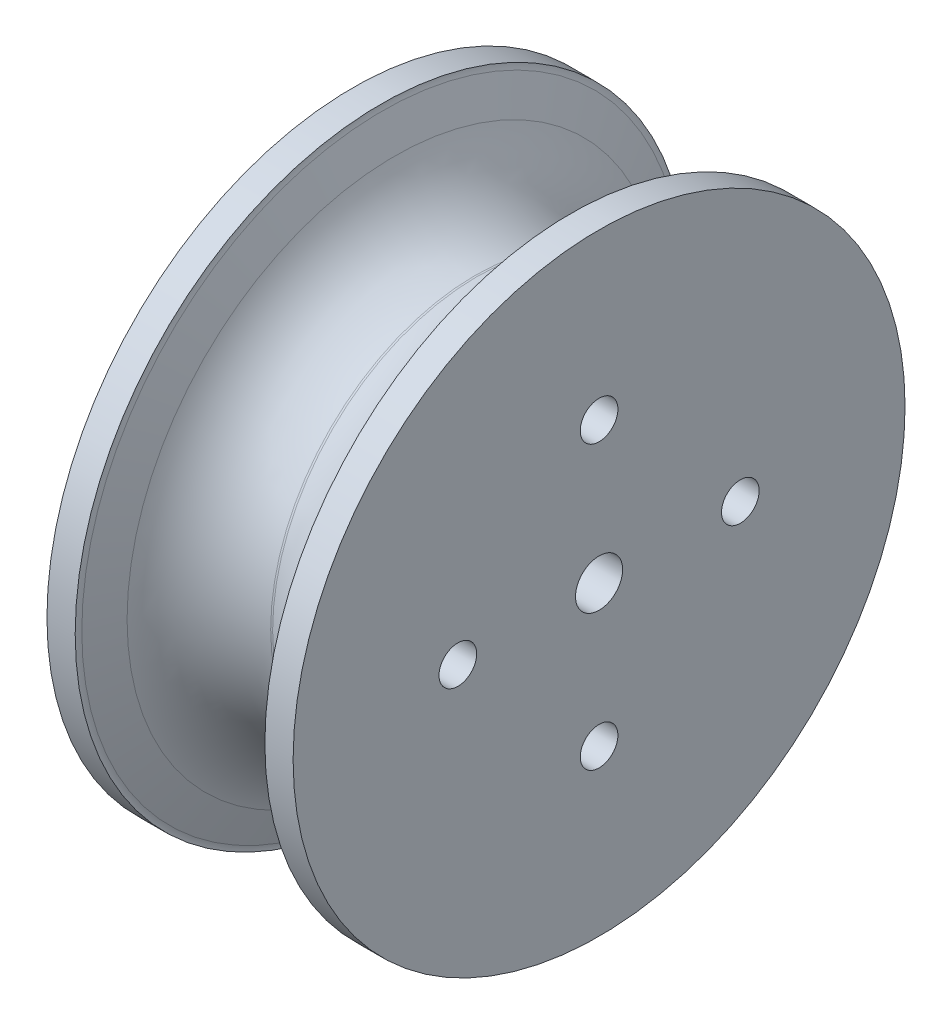
ISO-10303-21;
HEADER;
FILE_DESCRIPTION(('STEP AP214'),'2;1');
FILE_NAME('part.step','',(''),(''),'','','');
FILE_SCHEMA(('AUTOMOTIVE_DESIGN { 1 0 10303 214 1 1 1 1 }'));
ENDSEC;
DATA;
#1=APPLICATION_CONTEXT('core data for automotive mechanical design processes');
#2=APPLICATION_PROTOCOL_DEFINITION('international standard','automotive_design',2000,#1);
#3=PRODUCT_CONTEXT('',#1,'mechanical');
#4=PRODUCT('Part','Part','',(#3));
#5=PRODUCT_RELATED_PRODUCT_CATEGORY('part','',(#4));
#6=PRODUCT_DEFINITION_FORMATION('','',#4);
#7=PRODUCT_DEFINITION_CONTEXT('part definition',#1,'design');
#8=PRODUCT_DEFINITION('design','',#6,#7);
#9=PRODUCT_DEFINITION_SHAPE('','',#8);
#10=(LENGTH_UNIT() NAMED_UNIT(*) SI_UNIT(.MILLI.,.METRE.));
#11=(NAMED_UNIT(*) PLANE_ANGLE_UNIT() SI_UNIT($,.RADIAN.));
#12=(NAMED_UNIT(*) SI_UNIT($,.STERADIAN.) SOLID_ANGLE_UNIT());
#13=UNCERTAINTY_MEASURE_WITH_UNIT(LENGTH_MEASURE(1.E-05),#10,'distance_accuracy_value','');
#14=(GEOMETRIC_REPRESENTATION_CONTEXT(3) GLOBAL_UNCERTAINTY_ASSIGNED_CONTEXT((#13)) GLOBAL_UNIT_ASSIGNED_CONTEXT((#10,
#11,#12)) REPRESENTATION_CONTEXT('',''));
#15=CARTESIAN_POINT('',(0.,0.,0.));
#16=DIRECTION('',(0.,0.,1.));
#17=DIRECTION('',(1.,0.,0.));
#18=AXIS2_PLACEMENT_3D('',#15,#16,#17);
#19=CARTESIAN_POINT('',(0.,53.6000552133651,0.));
#20=DIRECTION('',(-1.,0.,0.));
#21=DIRECTION('',(0.,0.,1.));
#22=AXIS2_PLACEMENT_3D('',#19,#20,#21);
#23=TOROIDAL_SURFACE('',#22,22.5394735116362,0.839475181127807);
#24=CARTESIAN_POINT('',(-0.101961367565274,53.6000552133651,0.));
#25=DIRECTION('',(-1.,0.,0.));
#26=DIRECTION('',(0.,0.,1.));
#27=AXIS2_PLACEMENT_3D('',#24,#25,#26);
#28=CIRCLE('',#27,21.7062133726317);
#29=CARTESIAN_POINT('',(-0.101961367565274,53.6000552133651,21.7062133726317));
#30=VERTEX_POINT('',#29);
#31=EDGE_CURVE('E73',#30,#30,#28,.T.);
#32=ORIENTED_EDGE('',*,*,#31,.F.);
#33=EDGE_LOOP('',(#32));
#34=FACE_BOUND('',#33,.T.);
#35=CARTESIAN_POINT('',(0.101961367565274,53.6000552133651,0.));
#36=DIRECTION('',(-1.,0.,0.));
#37=DIRECTION('',(0.,0.,1.));
#38=AXIS2_PLACEMENT_3D('',#35,#36,#37);
#39=CIRCLE('',#38,21.7062133726317);
#40=CARTESIAN_POINT('',(0.101961367565274,53.6000552133651,21.7062133726317));
#41=VERTEX_POINT('',#40);
#42=EDGE_CURVE('E10',#41,#41,#39,.T.);
#43=ORIENTED_EDGE('',*,*,#42,.T.);
#44=EDGE_LOOP('',(#43));
#45=FACE_BOUND('',#44,.T.);
#46=ADVANCED_FACE('F33',(#34,#45),#23,.F.);
#47=CARTESIAN_POINT('',(-1.17297799352419,53.6000552133651,0.));
#48=DIRECTION('',(-1.,0.,0.));
#49=DIRECTION('',(0.,0.,1.));
#50=AXIS2_PLACEMENT_3D('',#47,#48,#49);
#51=TOROIDAL_SURFACE('',#50,32.1254160040951,10.4969163972068);
#52=CARTESIAN_POINT('',(8.64659436561641,53.6000552133651,0.));
#53=DIRECTION('',(-1.,0.,0.));
#54=DIRECTION('',(0.,0.,1.));
#55=AXIS2_PLACEMENT_3D('',#52,#53,#54);
#56=CIRCLE('',#55,28.4157997795309);
#57=CARTESIAN_POINT('',(8.64659436561641,53.6000552133651,28.4157997795309));
#58=VERTEX_POINT('',#57);
#59=EDGE_CURVE('E39',#58,#58,#56,.T.);
#60=ORIENTED_EDGE('',*,*,#59,.T.);
#61=EDGE_LOOP('',(#60));
#62=FACE_BOUND('',#61,.T.);
#63=ORIENTED_EDGE('',*,*,#42,.F.);
#64=EDGE_LOOP('',(#63));
#65=FACE_BOUND('',#64,.T.);
#66=ADVANCED_FACE('F132',(#62,#65),#51,.F.);
#67=CARTESIAN_POINT('',(9.96536302181998,53.6000552133651,0.));
#68=DIRECTION('',(1.,0.,0.));
#69=DIRECTION('',(0.,0.,-1.));
#70=AXIS2_PLACEMENT_3D('',#67,#68,#69);
#71=CONICAL_SURFACE('',#70,31.9066579871286,1.20959257130122);
#72=ORIENTED_EDGE('',*,*,#59,.F.);
#73=EDGE_LOOP('',(#72));
#74=FACE_BOUND('',#73,.T.);
#75=CARTESIAN_POINT('',(9.96536302181998,53.6000552133651,0.));
#76=DIRECTION('',(-1.,0.,0.));
#77=DIRECTION('',(0.,0.,1.));
#78=AXIS2_PLACEMENT_3D('',#75,#76,#77);
#79=CIRCLE('',#78,31.9066579871286);
#80=CARTESIAN_POINT('',(9.96536302181998,53.6000552133651,31.9066579871286));
#81=VERTEX_POINT('',#80);
#82=EDGE_CURVE('E43',#81,#81,#79,.T.);
#83=ORIENTED_EDGE('',*,*,#82,.T.);
#84=EDGE_LOOP('',(#83));
#85=FACE_BOUND('',#84,.T.);
#86=ADVANCED_FACE('F137',(#74,#85),#71,.T.);
#87=CARTESIAN_POINT('',(8.39475181127806,53.6000552133651,0.));
#88=DIRECTION('',(-1.,0.,0.));
#89=DIRECTION('',(0.,0.,1.));
#90=AXIS2_PLACEMENT_3D('',#87,#88,#89);
#91=TOROIDAL_SURFACE('',#90,32.5,1.67895036225561);
#92=CARTESIAN_POINT('',(10.0737021735337,53.6000552133651,0.));
#93=DIRECTION('',(-1.,0.,0.));
#94=DIRECTION('',(0.,0.,1.));
#95=AXIS2_PLACEMENT_3D('',#92,#93,#94);
#96=CIRCLE('',#95,32.5);
#97=CARTESIAN_POINT('',(10.0737021735337,53.6000552133651,32.5));
#98=VERTEX_POINT('',#97);
#99=EDGE_CURVE('E47',#98,#98,#96,.T.);
#100=ORIENTED_EDGE('',*,*,#99,.T.);
#101=EDGE_LOOP('',(#100));
#102=FACE_BOUND('',#101,.T.);
#103=ORIENTED_EDGE('',*,*,#82,.F.);
#104=EDGE_LOOP('',(#103));
#105=FACE_BOUND('',#104,.T.);
#106=ADVANCED_FACE('F247',(#102,#105),#91,.F.);
#107=CARTESIAN_POINT('',(-31.3430589886621,53.6000552133651,0.));
#108=DIRECTION('',(-1.,0.,0.));
#109=DIRECTION('',(0.,0.,1.));
#110=AXIS2_PLACEMENT_3D('',#107,#108,#109);
#111=CYLINDRICAL_SURFACE('',#110,32.5);
#112=CARTESIAN_POINT('',(13.0737021735337,53.6000552133651,0.));
#113=DIRECTION('',(-1.,0.,0.));
#114=DIRECTION('',(0.,0.,1.));
#115=AXIS2_PLACEMENT_3D('',#112,#113,#114);
#116=CIRCLE('',#115,32.5);
#117=CARTESIAN_POINT('',(13.0737021735337,53.6000552133651,32.5));
#118=VERTEX_POINT('',#117);
#119=EDGE_CURVE('E52',#118,#118,#116,.T.);
#120=ORIENTED_EDGE('',*,*,#119,.T.);
#121=EDGE_LOOP('',(#120));
#122=FACE_BOUND('',#121,.T.);
#123=ORIENTED_EDGE('',*,*,#99,.F.);
#124=EDGE_LOOP('',(#123));
#125=FACE_BOUND('',#124,.T.);
#126=ADVANCED_FACE('F127',(#122,#125),#111,.T.);
#127=CARTESIAN_POINT('',(13.0737021735337,0.,0.));
#128=DIRECTION('',(-1.,0.,0.));
#129=DIRECTION('',(0.,0.,1.));
#130=AXIS2_PLACEMENT_3D('',#127,#128,#129);
#131=PLANE('',#130);
#132=CARTESIAN_POINT('',(13.0737021735337,68.6000552133651,0.));
#133=DIRECTION('',(-1.,0.,0.));
#134=DIRECTION('',(0.,0.,1.));
#135=AXIS2_PLACEMENT_3D('',#132,#133,#134);
#136=CIRCLE('',#135,2.);
#137=CARTESIAN_POINT('',(13.0737021735337,68.6000552133651,2.));
#138=VERTEX_POINT('',#137);
#139=EDGE_CURVE('E76',#138,#138,#136,.T.);
#140=ORIENTED_EDGE('',*,*,#139,.T.);
#141=EDGE_LOOP('',(#140));
#142=FACE_BOUND('',#141,.T.);
#143=CARTESIAN_POINT('',(13.0737021735337,53.6000552133652,15.0000000000002));
#144=DIRECTION('',(-1.,0.,0.));
#145=DIRECTION('',(0.,0.,1.));
#146=AXIS2_PLACEMENT_3D('',#143,#144,#145);
#147=CIRCLE('',#146,2.);
#148=CARTESIAN_POINT('',(13.0737021735337,53.6000552133652,17.0000000000002));
#149=VERTEX_POINT('',#148);
#150=EDGE_CURVE('E79',#149,#149,#147,.T.);
#151=ORIENTED_EDGE('',*,*,#150,.T.);
#152=EDGE_LOOP('',(#151));
#153=FACE_BOUND('',#152,.T.);
#154=CARTESIAN_POINT('',(13.0737021735337,38.6000552133651,3.14233320495882E-13));
#155=DIRECTION('',(-1.,0.,0.));
#156=DIRECTION('',(0.,0.,1.));
#157=AXIS2_PLACEMENT_3D('',#154,#155,#156);
#158=CIRCLE('',#157,2.);
#159=CARTESIAN_POINT('',(13.0737021735337,38.6000552133651,2.00000000000031));
#160=VERTEX_POINT('',#159);
#161=EDGE_CURVE('E82',#160,#160,#158,.T.);
#162=ORIENTED_EDGE('',*,*,#161,.T.);
#163=EDGE_LOOP('',(#162));
#164=FACE_BOUND('',#163,.T.);
#165=CARTESIAN_POINT('',(13.0737021735337,53.600055213365,-14.9999999999998));
#166=DIRECTION('',(-1.,0.,0.));
#167=DIRECTION('',(0.,0.,1.));
#168=AXIS2_PLACEMENT_3D('',#165,#166,#167);
#169=CIRCLE('',#168,2.);
#170=CARTESIAN_POINT('',(13.0737021735337,53.600055213365,-12.9999999999998));
#171=VERTEX_POINT('',#170);
#172=EDGE_CURVE('E85',#171,#171,#169,.T.);
#173=ORIENTED_EDGE('',*,*,#172,.T.);
#174=EDGE_LOOP('',(#173));
#175=FACE_BOUND('',#174,.T.);
#176=ORIENTED_EDGE('',*,*,#119,.F.);
#177=EDGE_LOOP('',(#176));
#178=FACE_BOUND('',#177,.T.);
#179=CARTESIAN_POINT('',(13.0737021735337,53.6000552133651,0.));
#180=DIRECTION('',(-1.,0.,0.));
#181=DIRECTION('',(0.,0.,1.));
#182=AXIS2_PLACEMENT_3D('',#179,#180,#181);
#183=CIRCLE('',#182,2.5);
#184=CARTESIAN_POINT('',(13.0737021735337,53.6000552133651,2.5));
#185=VERTEX_POINT('',#184);
#186=EDGE_CURVE('E55',#185,#185,#183,.T.);
#187=ORIENTED_EDGE('',*,*,#186,.T.);
#188=EDGE_LOOP('',(#187));
#189=FACE_BOUND('',#188,.T.);
#190=ADVANCED_FACE('F121',(#142,#153,#164,#175,#178,#189),#131,.F.);
#191=CARTESIAN_POINT('',(-31.3430589886621,53.6000552133651,0.));
#192=DIRECTION('',(-1.,0.,0.));
#193=DIRECTION('',(0.,0.,1.));
#194=AXIS2_PLACEMENT_3D('',#191,#192,#193);
#195=CYLINDRICAL_SURFACE('',#194,2.5);
#196=ORIENTED_EDGE('',*,*,#186,.F.);
#197=EDGE_LOOP('',(#196));
#198=FACE_BOUND('',#197,.T.);
#199=CARTESIAN_POINT('',(-13.0737021735337,53.6000552133651,0.));
#200=DIRECTION('',(-1.,0.,0.));
#201=DIRECTION('',(0.,0.,1.));
#202=AXIS2_PLACEMENT_3D('',#199,#200,#201);
#203=CIRCLE('',#202,2.5);
#204=CARTESIAN_POINT('',(-13.0737021735337,53.6000552133651,2.5));
#205=VERTEX_POINT('',#204);
#206=EDGE_CURVE('E58',#205,#205,#203,.T.);
#207=ORIENTED_EDGE('',*,*,#206,.T.);
#208=EDGE_LOOP('',(#207));
#209=FACE_BOUND('',#208,.T.);
#210=ADVANCED_FACE('F108',(#198,#209),#195,.F.);
#211=CARTESIAN_POINT('',(-13.0737021735337,0.,0.));
#212=DIRECTION('',(-1.,0.,0.));
#213=DIRECTION('',(0.,0.,1.));
#214=AXIS2_PLACEMENT_3D('',#211,#212,#213);
#215=PLANE('',#214);
#216=CARTESIAN_POINT('',(-13.0737021735337,68.6000552133651,0.));
#217=DIRECTION('',(-1.,0.,0.));
#218=DIRECTION('',(0.,0.,1.));
#219=AXIS2_PLACEMENT_3D('',#216,#217,#218);
#220=CIRCLE('',#219,2.);
#221=CARTESIAN_POINT('',(-13.0737021735337,68.6000552133651,2.));
#222=VERTEX_POINT('',#221);
#223=EDGE_CURVE('E88',#222,#222,#220,.T.);
#224=ORIENTED_EDGE('',*,*,#223,.F.);
#225=EDGE_LOOP('',(#224));
#226=FACE_BOUND('',#225,.T.);
#227=CARTESIAN_POINT('',(-13.0737021735337,53.6000552133652,15.0000000000002));
#228=DIRECTION('',(-1.,0.,0.));
#229=DIRECTION('',(0.,0.,1.));
#230=AXIS2_PLACEMENT_3D('',#227,#228,#229);
#231=CIRCLE('',#230,2.);
#232=CARTESIAN_POINT('',(-13.0737021735337,53.6000552133652,17.0000000000002));
#233=VERTEX_POINT('',#232);
#234=EDGE_CURVE('E95',#233,#233,#231,.T.);
#235=ORIENTED_EDGE('',*,*,#234,.F.);
#236=EDGE_LOOP('',(#235));
#237=FACE_BOUND('',#236,.T.);
#238=CARTESIAN_POINT('',(-13.0737021735337,38.6000552133651,3.14233320495882E-13));
#239=DIRECTION('',(-1.,0.,0.));
#240=DIRECTION('',(0.,0.,1.));
#241=AXIS2_PLACEMENT_3D('',#238,#239,#240);
#242=CIRCLE('',#241,2.);
#243=CARTESIAN_POINT('',(-13.0737021735337,38.6000552133651,2.00000000000031));
#244=VERTEX_POINT('',#243);
#245=EDGE_CURVE('E92',#244,#244,#242,.T.);
#246=ORIENTED_EDGE('',*,*,#245,.F.);
#247=EDGE_LOOP('',(#246));
#248=FACE_BOUND('',#247,.T.);
#249=CARTESIAN_POINT('',(-13.0737021735337,53.600055213365,-14.9999999999998));
#250=DIRECTION('',(-1.,0.,0.));
#251=DIRECTION('',(0.,0.,1.));
#252=AXIS2_PLACEMENT_3D('',#249,#250,#251);
#253=CIRCLE('',#252,2.);
#254=CARTESIAN_POINT('',(-13.0737021735337,53.600055213365,-12.9999999999998));
#255=VERTEX_POINT('',#254);
#256=EDGE_CURVE('E89',#255,#255,#253,.T.);
#257=ORIENTED_EDGE('',*,*,#256,.F.);
#258=EDGE_LOOP('',(#257));
#259=FACE_BOUND('',#258,.T.);
#260=CARTESIAN_POINT('',(-13.0737021735337,53.6000552133651,0.));
#261=DIRECTION('',(-1.,0.,0.));
#262=DIRECTION('',(0.,0.,1.));
#263=AXIS2_PLACEMENT_3D('',#260,#261,#262);
#264=CIRCLE('',#263,32.5);
#265=CARTESIAN_POINT('',(-13.0737021735337,53.6000552133651,32.5));
#266=VERTEX_POINT('',#265);
#267=EDGE_CURVE('E61',#266,#266,#264,.T.);
#268=ORIENTED_EDGE('',*,*,#267,.T.);
#269=EDGE_LOOP('',(#268));
#270=FACE_BOUND('',#269,.T.);
#271=ORIENTED_EDGE('',*,*,#206,.F.);
#272=EDGE_LOOP('',(#271));
#273=FACE_BOUND('',#272,.T.);
#274=ADVANCED_FACE('F104',(#226,#237,#248,#259,#270,#273),#215,.T.);
#275=CARTESIAN_POINT('',(-31.3430589886621,53.6000552133651,0.));
#276=DIRECTION('',(-1.,0.,0.));
#277=DIRECTION('',(0.,0.,1.));
#278=AXIS2_PLACEMENT_3D('',#275,#276,#277);
#279=CYLINDRICAL_SURFACE('',#278,32.5);
#280=ORIENTED_EDGE('',*,*,#267,.F.);
#281=EDGE_LOOP('',(#280));
#282=FACE_BOUND('',#281,.T.);
#283=CARTESIAN_POINT('',(-10.0737021735337,53.6000552133651,0.));
#284=DIRECTION('',(-1.,0.,0.));
#285=DIRECTION('',(0.,0.,1.));
#286=AXIS2_PLACEMENT_3D('',#283,#284,#285);
#287=CIRCLE('',#286,32.5);
#288=CARTESIAN_POINT('',(-10.0737021735337,53.6000552133651,32.5));
#289=VERTEX_POINT('',#288);
#290=EDGE_CURVE('E64',#289,#289,#287,.T.);
#291=ORIENTED_EDGE('',*,*,#290,.T.);
#292=EDGE_LOOP('',(#291));
#293=FACE_BOUND('',#292,.T.);
#294=ADVANCED_FACE('F107',(#282,#293),#279,.T.);
#295=CARTESIAN_POINT('',(-8.39475181127806,53.6000552133651,0.));
#296=DIRECTION('',(-1.,0.,0.));
#297=DIRECTION('',(0.,0.,1.));
#298=AXIS2_PLACEMENT_3D('',#295,#296,#297);
#299=TOROIDAL_SURFACE('',#298,32.5,1.67895036225561);
#300=ORIENTED_EDGE('',*,*,#290,.F.);
#301=EDGE_LOOP('',(#300));
#302=FACE_BOUND('',#301,.T.);
#303=CARTESIAN_POINT('',(-9.96536302181998,53.6000552133651,0.));
#304=DIRECTION('',(-1.,0.,0.));
#305=DIRECTION('',(0.,0.,1.));
#306=AXIS2_PLACEMENT_3D('',#303,#304,#305);
#307=CIRCLE('',#306,31.9066579871286);
#308=CARTESIAN_POINT('',(-9.96536302181998,53.6000552133651,31.9066579871286));
#309=VERTEX_POINT('',#308);
#310=EDGE_CURVE('E67',#309,#309,#307,.T.);
#311=ORIENTED_EDGE('',*,*,#310,.T.);
#312=EDGE_LOOP('',(#311));
#313=FACE_BOUND('',#312,.T.);
#314=ADVANCED_FACE('F153',(#302,#313),#299,.F.);
#315=CARTESIAN_POINT('',(-9.96536302181998,53.6000552133651,0.));
#316=DIRECTION('',(-1.,0.,0.));
#317=DIRECTION('',(0.,0.,1.));
#318=AXIS2_PLACEMENT_3D('',#315,#316,#317);
#319=CONICAL_SURFACE('',#318,31.9066579871286,1.20959257130122);
#320=CARTESIAN_POINT('',(-8.64659436561641,53.6000552133651,0.));
#321=DIRECTION('',(-1.,0.,0.));
#322=DIRECTION('',(0.,0.,1.));
#323=AXIS2_PLACEMENT_3D('',#320,#321,#322);
#324=CIRCLE('',#323,28.4157997795309);
#325=CARTESIAN_POINT('',(-8.64659436561641,53.6000552133651,28.4157997795309));
#326=VERTEX_POINT('',#325);
#327=EDGE_CURVE('E70',#326,#326,#324,.T.);
#328=ORIENTED_EDGE('',*,*,#327,.T.);
#329=EDGE_LOOP('',(#328));
#330=FACE_BOUND('',#329,.T.);
#331=ORIENTED_EDGE('',*,*,#310,.F.);
#332=EDGE_LOOP('',(#331));
#333=FACE_BOUND('',#332,.T.);
#334=ADVANCED_FACE('F143',(#330,#333),#319,.T.);
#335=CARTESIAN_POINT('',(1.17297799352419,53.6000552133651,0.));
#336=DIRECTION('',(-1.,0.,0.));
#337=DIRECTION('',(0.,0.,1.));
#338=AXIS2_PLACEMENT_3D('',#335,#336,#337);
#339=TOROIDAL_SURFACE('',#338,32.1254160040951,10.4969163972068);
#340=ORIENTED_EDGE('',*,*,#327,.F.);
#341=EDGE_LOOP('',(#340));
#342=FACE_BOUND('',#341,.T.);
#343=ORIENTED_EDGE('',*,*,#31,.T.);
#344=EDGE_LOOP('',(#343));
#345=FACE_BOUND('',#344,.T.);
#346=ADVANCED_FACE('F140',(#342,#345),#339,.F.);
#347=CARTESIAN_POINT('',(17.9262978264663,53.600055213365,-14.9999999999998));
#348=DIRECTION('',(-1.,0.,0.));
#349=DIRECTION('',(0.,0.,1.));
#350=AXIS2_PLACEMENT_3D('',#347,#348,#349);
#351=CYLINDRICAL_SURFACE('',#350,2.);
#352=ORIENTED_EDGE('',*,*,#256,.T.);
#353=EDGE_LOOP('',(#352));
#354=FACE_BOUND('',#353,.T.);
#355=ORIENTED_EDGE('',*,*,#172,.F.);
#356=EDGE_LOOP('',(#355));
#357=FACE_BOUND('',#356,.T.);
#358=ADVANCED_FACE('F142',(#354,#357),#351,.F.);
#359=CARTESIAN_POINT('',(17.9262978264663,38.6000552133651,3.14233320495882E-13));
#360=DIRECTION('',(-1.,0.,0.));
#361=DIRECTION('',(0.,0.,1.));
#362=AXIS2_PLACEMENT_3D('',#359,#360,#361);
#363=CYLINDRICAL_SURFACE('',#362,2.);
#364=ORIENTED_EDGE('',*,*,#245,.T.);
#365=EDGE_LOOP('',(#364));
#366=FACE_BOUND('',#365,.T.);
#367=ORIENTED_EDGE('',*,*,#161,.F.);
#368=EDGE_LOOP('',(#367));
#369=FACE_BOUND('',#368,.T.);
#370=ADVANCED_FACE('F150',(#366,#369),#363,.F.);
#371=CARTESIAN_POINT('',(17.9262978264663,53.6000552133652,15.0000000000002));
#372=DIRECTION('',(-1.,0.,0.));
#373=DIRECTION('',(0.,0.,1.));
#374=AXIS2_PLACEMENT_3D('',#371,#372,#373);
#375=CYLINDRICAL_SURFACE('',#374,2.);
#376=ORIENTED_EDGE('',*,*,#234,.T.);
#377=EDGE_LOOP('',(#376));
#378=FACE_BOUND('',#377,.T.);
#379=ORIENTED_EDGE('',*,*,#150,.F.);
#380=EDGE_LOOP('',(#379));
#381=FACE_BOUND('',#380,.T.);
#382=ADVANCED_FACE('F214',(#378,#381),#375,.F.);
#383=CARTESIAN_POINT('',(17.9262978264663,68.6000552133651,0.));
#384=DIRECTION('',(-1.,0.,0.));
#385=DIRECTION('',(0.,0.,1.));
#386=AXIS2_PLACEMENT_3D('',#383,#384,#385);
#387=CYLINDRICAL_SURFACE('',#386,2.);
#388=ORIENTED_EDGE('',*,*,#223,.T.);
#389=EDGE_LOOP('',(#388));
#390=FACE_BOUND('',#389,.T.);
#391=ORIENTED_EDGE('',*,*,#139,.F.);
#392=EDGE_LOOP('',(#391));
#393=FACE_BOUND('',#392,.T.);
#394=ADVANCED_FACE('F101',(#390,#393),#387,.F.);
#395=CLOSED_SHELL('',(#46,#66,#86,#106,#126,#190,#210,#274,#294,#314,#334,#346,#358,#370,#382,#394));
#396=MANIFOLD_SOLID_BREP('B2',#395);
#397=ADVANCED_BREP_SHAPE_REPRESENTATION('',(#18,#396),#14);
#398=SHAPE_DEFINITION_REPRESENTATION(#9,#397);
ENDSEC;
END-ISO-10303-21;
